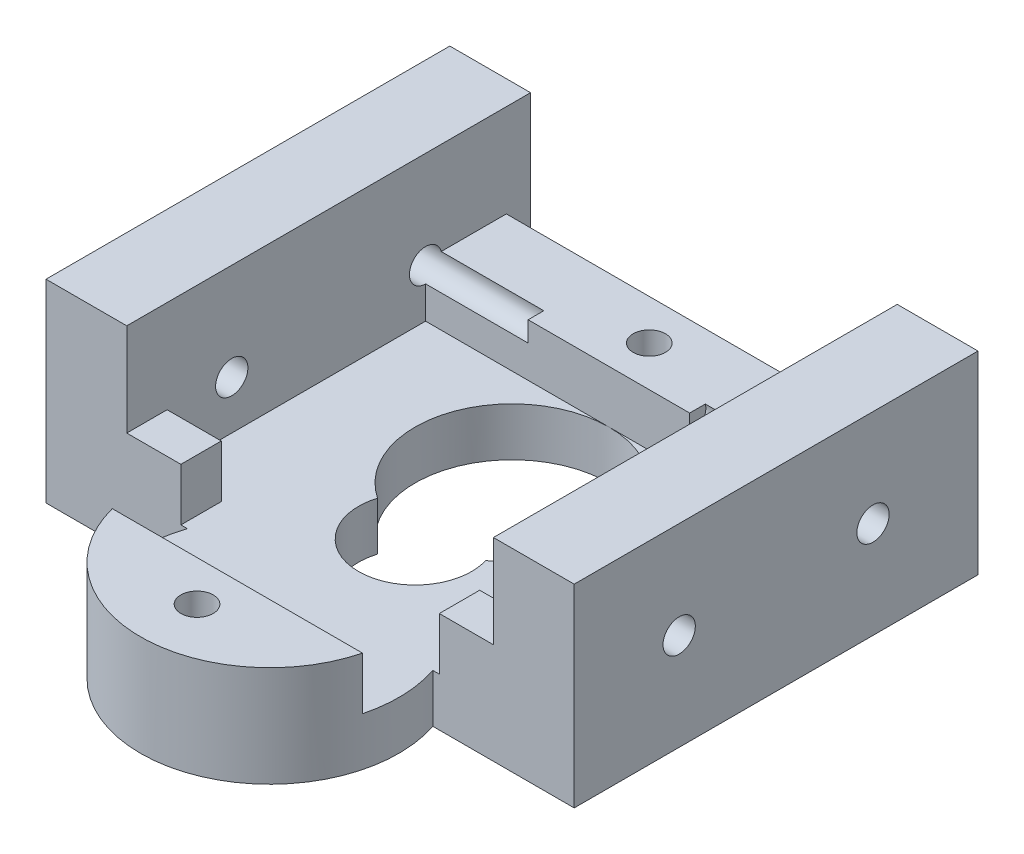
ISO-10303-21;
HEADER;
FILE_DESCRIPTION(('STEP AP214'),'2;1');
FILE_NAME('part.step','',(''),(''),'','','');
FILE_SCHEMA(('AUTOMOTIVE_DESIGN { 1 0 10303 214 1 1 1 1 }'));
ENDSEC;
DATA;
#1=APPLICATION_CONTEXT('core data for automotive mechanical design processes');
#2=APPLICATION_PROTOCOL_DEFINITION('international standard','automotive_design',2000,#1);
#3=PRODUCT_CONTEXT('',#1,'mechanical');
#4=PRODUCT('Part','Part','',(#3));
#5=PRODUCT_RELATED_PRODUCT_CATEGORY('part','',(#4));
#6=PRODUCT_DEFINITION_FORMATION('','',#4);
#7=PRODUCT_DEFINITION_CONTEXT('part definition',#1,'design');
#8=PRODUCT_DEFINITION('design','',#6,#7);
#9=PRODUCT_DEFINITION_SHAPE('','',#8);
#10=(LENGTH_UNIT() NAMED_UNIT(*) SI_UNIT(.MILLI.,.METRE.));
#11=(NAMED_UNIT(*) PLANE_ANGLE_UNIT() SI_UNIT($,.RADIAN.));
#12=(NAMED_UNIT(*) SI_UNIT($,.STERADIAN.) SOLID_ANGLE_UNIT());
#13=UNCERTAINTY_MEASURE_WITH_UNIT(LENGTH_MEASURE(1.E-05),#10,'distance_accuracy_value','');
#14=(GEOMETRIC_REPRESENTATION_CONTEXT(3) GLOBAL_UNCERTAINTY_ASSIGNED_CONTEXT((#13)) GLOBAL_UNIT_ASSIGNED_CONTEXT((#10,
#11,#12)) REPRESENTATION_CONTEXT('',''));
#15=CARTESIAN_POINT('',(0.,0.,0.));
#16=DIRECTION('',(0.,0.,1.));
#17=DIRECTION('',(1.,0.,0.));
#18=AXIS2_PLACEMENT_3D('',#15,#16,#17);
#19=CARTESIAN_POINT('',(0.,6.25,0.));
#20=DIRECTION('',(0.,1.,0.));
#21=DIRECTION('',(0.,0.,1.));
#22=AXIS2_PLACEMENT_3D('',#19,#20,#21);
#23=PLANE('',#22);
#24=DIRECTION('',(1.,0.,0.));
#25=VECTOR('',#24,1.);
#26=CARTESIAN_POINT('',(8.22691143861223,6.25,7.13654379867821));
#27=LINE('',#26,#25);
#28=CARTESIAN_POINT('',(8.22691143861223,6.25,7.13654379867821));
#29=VERTEX_POINT('',#28);
#30=CARTESIAN_POINT('',(11.5769114386122,6.25,7.13654379867821));
#31=VERTEX_POINT('',#30);
#32=EDGE_CURVE('E337',#29,#31,#27,.T.);
#33=ORIENTED_EDGE('',*,*,#32,.T.);
#34=DIRECTION('',(0.,0.,-1.));
#35=VECTOR('',#34,1.);
#36=CARTESIAN_POINT('',(11.5769114386122,6.25,0.));
#37=LINE('',#36,#35);
#38=CARTESIAN_POINT('',(11.5769114386122,6.25,4.63654379867821));
#39=VERTEX_POINT('',#38);
#40=EDGE_CURVE('E539',#31,#39,#37,.T.);
#41=ORIENTED_EDGE('',*,*,#40,.T.);
#42=DIRECTION('',(-1.,0.,0.));
#43=VECTOR('',#42,1.);
#44=CARTESIAN_POINT('',(11.5769114386122,6.25,4.63654379867821));
#45=LINE('',#44,#43);
#46=CARTESIAN_POINT('',(8.22691143861223,6.25,4.63654379867821));
#47=VERTEX_POINT('',#46);
#48=EDGE_CURVE('E331',#39,#47,#45,.T.);
#49=ORIENTED_EDGE('',*,*,#48,.T.);
#50=DIRECTION('',(0.,0.,1.));
#51=VECTOR('',#50,1.);
#52=CARTESIAN_POINT('',(8.22691143861223,6.25,7.13654379867821));
#53=LINE('',#52,#51);
#54=EDGE_CURVE('E334',#47,#29,#53,.T.);
#55=ORIENTED_EDGE('',*,*,#54,.T.);
#56=EDGE_LOOP('',(#33,#41,#49,#55));
#57=FACE_BOUND('',#56,.T.);
#58=ADVANCED_FACE('F39',(#57),#23,.T.);
#59=CARTESIAN_POINT('',(0.226911587156249,6.25,-13.8634563483621));
#60=DIRECTION('',(0.,1.,0.));
#61=DIRECTION('',(0.,0.,1.));
#62=AXIS2_PLACEMENT_3D('',#59,#60,#61);
#63=CIRCLE('',#62,1.00000013768779);
#64=CARTESIAN_POINT('',(0.226911587156249,6.25,-12.8634562106743));
#65=VERTEX_POINT('',#64);
#66=EDGE_CURVE('E642',#65,#65,#63,.T.);
#67=ORIENTED_EDGE('',*,*,#66,.F.);
#68=EDGE_LOOP('',(#67));
#69=FACE_BOUND('',#68,.T.);
#70=DIRECTION('',(1.,0.,0.));
#71=VECTOR('',#70,1.);
#72=CARTESIAN_POINT('',(5.22691182008223,6.25,-12.3317020378736));
#73=LINE('',#72,#71);
#74=CARTESIAN_POINT('',(11.5769114386122,6.25,-12.3317020378736));
#75=VERTEX_POINT('',#74);
#76=CARTESIAN_POINT('',(5.22691182008223,6.25,-12.3317020378736));
#77=VERTEX_POINT('',#76);
#78=EDGE_CURVE('E226',#75,#77,#73,.F.);
#79=ORIENTED_EDGE('',*,*,#78,.F.);
#80=CARTESIAN_POINT('',(11.5769114386122,6.25,-16.3634562013218));
#81=VERTEX_POINT('',#80);
#82=EDGE_CURVE('E536',#75,#81,#37,.T.);
#83=ORIENTED_EDGE('',*,*,#82,.T.);
#84=DIRECTION('',(-1.,0.,0.));
#85=VECTOR('',#84,1.);
#86=CARTESIAN_POINT('',(-11.1230885613878,6.25,-16.3634562013218));
#87=LINE('',#86,#85);
#88=CARTESIAN_POINT('',(-11.1230885613878,6.25,-16.3634562013218));
#89=VERTEX_POINT('',#88);
#90=EDGE_CURVE('E340',#81,#89,#87,.T.);
#91=ORIENTED_EDGE('',*,*,#90,.T.);
#92=DIRECTION('',(0.,0.,-1.));
#93=VECTOR('',#92,1.);
#94=CARTESIAN_POINT('',(-11.1230885613878,6.25,7.13654379867821));
#95=LINE('',#94,#93);
#96=CARTESIAN_POINT('',(-11.1230885613878,6.25,-12.3317020378736));
#97=VERTEX_POINT('',#96);
#98=EDGE_CURVE('E314',#97,#89,#95,.T.);
#99=ORIENTED_EDGE('',*,*,#98,.F.);
#100=DIRECTION('',(-1.,0.,0.));
#101=VECTOR('',#100,1.);
#102=CARTESIAN_POINT('',(-4.77308894285778,6.25,-12.3317020378736));
#103=LINE('',#102,#101);
#104=CARTESIAN_POINT('',(-4.77308894285778,6.25,-12.3317020378736));
#105=VERTEX_POINT('',#104);
#106=EDGE_CURVE('E270',#105,#97,#103,.T.);
#107=ORIENTED_EDGE('',*,*,#106,.F.);
#108=DIRECTION('',(0.,0.,1.));
#109=VECTOR('',#108,1.);
#110=CARTESIAN_POINT('',(-4.77308894285778,6.25,0.));
#111=LINE('',#110,#109);
#112=CARTESIAN_POINT('',(-4.77308894285778,6.25,-11.3627555767347));
#113=VERTEX_POINT('',#112);
#114=EDGE_CURVE('E260',#105,#113,#111,.T.);
#115=ORIENTED_EDGE('',*,*,#114,.T.);
#116=DIRECTION('',(1.,0.,0.));
#117=VECTOR('',#116,1.);
#118=CARTESIAN_POINT('',(-11.1230885613878,6.25,-11.3627555767347));
#119=LINE('',#118,#117);
#120=CARTESIAN_POINT('',(5.22691182008223,6.25,-11.3627555767347));
#121=VERTEX_POINT('',#120);
#122=EDGE_CURVE('E248',#113,#121,#119,.T.);
#123=ORIENTED_EDGE('',*,*,#122,.T.);
#124=DIRECTION('',(0.,0.,-1.));
#125=VECTOR('',#124,1.);
#126=CARTESIAN_POINT('',(5.22691182008223,6.25,0.));
#127=LINE('',#126,#125);
#128=EDGE_CURVE('E235',#121,#77,#127,.T.);
#129=ORIENTED_EDGE('',*,*,#128,.T.);
#130=EDGE_LOOP('',(#79,#83,#91,#99,#107,#115,#123,#129));
#131=FACE_BOUND('',#130,.T.);
#132=ADVANCED_FACE('F245',(#69,#131),#23,.T.);
#133=CARTESIAN_POINT('',(-11.1230885613878,6.25,7.13654379867821));
#134=VERTEX_POINT('',#133);
#135=CARTESIAN_POINT('',(-11.1230885613878,6.25,4.63654379867821));
#136=VERTEX_POINT('',#135);
#137=EDGE_CURVE('E294',#134,#136,#95,.T.);
#138=ORIENTED_EDGE('',*,*,#137,.F.);
#139=DIRECTION('',(1.,0.,0.));
#140=VECTOR('',#139,1.);
#141=CARTESIAN_POINT('',(-16.1230889428578,6.25,7.13654379867821));
#142=LINE('',#141,#140);
#143=CARTESIAN_POINT('',(-7.77308856138777,6.25,7.13654379867821));
#144=VERTEX_POINT('',#143);
#145=EDGE_CURVE('E319',#134,#144,#142,.T.);
#146=ORIENTED_EDGE('',*,*,#145,.T.);
#147=DIRECTION('',(0.,0.,-1.));
#148=VECTOR('',#147,1.);
#149=CARTESIAN_POINT('',(-7.77308856138777,6.25,7.13654379867821));
#150=LINE('',#149,#148);
#151=CARTESIAN_POINT('',(-7.77308856138777,6.25,4.63654379867821));
#152=VERTEX_POINT('',#151);
#153=EDGE_CURVE('E322',#144,#152,#150,.T.);
#154=ORIENTED_EDGE('',*,*,#153,.T.);
#155=DIRECTION('',(-1.,0.,0.));
#156=VECTOR('',#155,1.);
#157=CARTESIAN_POINT('',(-11.1230885613878,6.25,4.63654379867821));
#158=LINE('',#157,#156);
#159=EDGE_CURVE('E326',#152,#136,#158,.T.);
#160=ORIENTED_EDGE('',*,*,#159,.T.);
#161=EDGE_LOOP('',(#138,#146,#154,#160));
#162=FACE_BOUND('',#161,.T.);
#163=ADVANCED_FACE('F679',(#162),#23,.T.);
#164=CARTESIAN_POINT('',(0.226911133434606,3.,9.63654492163518));
#165=DIRECTION('',(0.,1.,0.));
#166=DIRECTION('',(0.,0.,1.));
#167=AXIS2_PLACEMENT_3D('',#164,#165,#166);
#168=PLANE('',#167);
#169=DIRECTION('',(-1.,0.,0.));
#170=VECTOR('',#169,1.);
#171=CARTESIAN_POINT('',(-11.1230885613878,3.,4.63654379867821));
#172=LINE('',#171,#170);
#173=CARTESIAN_POINT('',(-7.77308856138777,3.,4.63654379867821));
#174=VERTEX_POINT('',#173);
#175=CARTESIAN_POINT('',(-11.1230885613878,3.,4.63654379867821));
#176=VERTEX_POINT('',#175);
#177=EDGE_CURVE('E348',#174,#176,#172,.T.);
#178=ORIENTED_EDGE('',*,*,#177,.F.);
#179=DIRECTION('',(0.,0.,-1.));
#180=VECTOR('',#179,1.);
#181=CARTESIAN_POINT('',(-7.77308856138777,3.,7.13654379867821));
#182=LINE('',#181,#180);
#183=CARTESIAN_POINT('',(-7.77308856138777,3.,7.13654379867821));
#184=VERTEX_POINT('',#183);
#185=EDGE_CURVE('E318',#184,#174,#182,.T.);
#186=ORIENTED_EDGE('',*,*,#185,.F.);
#187=DIRECTION('',(1.,0.,0.));
#188=VECTOR('',#187,1.);
#189=CARTESIAN_POINT('',(-16.1230889428578,3.,7.13654379867821));
#190=LINE('',#189,#188);
#191=CARTESIAN_POINT('',(-7.37243040662027,3.,7.13654379867821));
#192=VERTEX_POINT('',#191);
#193=EDGE_CURVE('E481',#184,#192,#190,.T.);
#194=ORIENTED_EDGE('',*,*,#193,.T.);
#195=CARTESIAN_POINT('',(0.226911133434606,3.,9.63654492163518));
#196=DIRECTION('',(0.,1.,0.));
#197=DIRECTION('',(0.,0.,1.));
#198=AXIS2_PLACEMENT_3D('',#195,#196,#197);
#199=CIRCLE('',#198,7.99999984107436);
#200=CARTESIAN_POINT('',(-7.51905539484253,3.,11.6365449216352));
#201=VERTEX_POINT('',#200);
#202=EDGE_CURVE('E486',#192,#201,#199,.T.);
#203=ORIENTED_EDGE('',*,*,#202,.T.);
#204=DIRECTION('',(-1.,0.,0.));
#205=VECTOR('',#204,1.);
#206=CARTESIAN_POINT('',(-7.51905539484253,3.,11.6365449216352));
#207=LINE('',#206,#205);
#208=CARTESIAN_POINT('',(7.97287766171174,3.,11.6365449216352));
#209=VERTEX_POINT('',#208);
#210=EDGE_CURVE('E429',#209,#201,#207,.T.);
#211=ORIENTED_EDGE('',*,*,#210,.F.);
#212=CARTESIAN_POINT('',(7.82625267348948,3.,7.13654379867821));
#213=VERTEX_POINT('',#212);
#214=EDGE_CURVE('E484',#209,#213,#199,.T.);
#215=ORIENTED_EDGE('',*,*,#214,.T.);
#216=DIRECTION('',(1.,0.,0.));
#217=VECTOR('',#216,1.);
#218=CARTESIAN_POINT('',(7.82625267348948,3.,7.13654379867821));
#219=LINE('',#218,#217);
#220=CARTESIAN_POINT('',(8.22691143861223,3.,7.13654379867821));
#221=VERTEX_POINT('',#220);
#222=EDGE_CURVE('E489',#213,#221,#219,.T.);
#223=ORIENTED_EDGE('',*,*,#222,.T.);
#224=DIRECTION('',(0.,0.,1.));
#225=VECTOR('',#224,1.);
#226=CARTESIAN_POINT('',(8.22691143861223,3.,7.13654379867821));
#227=LINE('',#226,#225);
#228=CARTESIAN_POINT('',(8.22691143861223,3.,4.63654379867821));
#229=VERTEX_POINT('',#228);
#230=EDGE_CURVE('E369',#229,#221,#227,.T.);
#231=ORIENTED_EDGE('',*,*,#230,.F.);
#232=DIRECTION('',(-1.,0.,0.));
#233=VECTOR('',#232,1.);
#234=CARTESIAN_POINT('',(11.5769114386122,3.,4.63654379867821));
#235=LINE('',#234,#233);
#236=CARTESIAN_POINT('',(11.5769114386122,3.,4.63654379867821));
#237=VERTEX_POINT('',#236);
#238=EDGE_CURVE('E365',#237,#229,#235,.T.);
#239=ORIENTED_EDGE('',*,*,#238,.F.);
#240=DIRECTION('',(0.,0.,1.));
#241=VECTOR('',#240,1.);
#242=CARTESIAN_POINT('',(11.5769114386122,3.,4.63654379867821));
#243=LINE('',#242,#241);
#244=CARTESIAN_POINT('',(11.5769114386122,3.,-11.3627555767347));
#245=VERTEX_POINT('',#244);
#246=EDGE_CURVE('E361',#245,#237,#243,.T.);
#247=ORIENTED_EDGE('',*,*,#246,.F.);
#248=DIRECTION('',(1.,0.,0.));
#249=VECTOR('',#248,1.);
#250=CARTESIAN_POINT('',(-11.1230885613878,3.,-11.3627555767347));
#251=LINE('',#250,#249);
#252=CARTESIAN_POINT('',(0.225173588169157,3.,-11.3627555767347));
#253=VERTEX_POINT('',#252);
#254=EDGE_CURVE('E356',#253,#245,#251,.T.);
#255=ORIENTED_EDGE('',*,*,#254,.F.);
#256=CARTESIAN_POINT('',(0.225173588169157,3.,-5.36455943319));
#257=DIRECTION('',(0.,1.,0.));
#258=DIRECTION('',(0.,0.,1.));
#259=AXIS2_PLACEMENT_3D('',#256,#257,#258);
#260=CIRCLE('',#259,5.99819614354473);
#261=CARTESIAN_POINT('',(3.57360520697962,3.,-0.387978009101258));
#262=VERTEX_POINT('',#261);
#263=EDGE_CURVE('E457',#262,#253,#260,.T.);
#264=ORIENTED_EDGE('',*,*,#263,.F.);
#265=CARTESIAN_POINT('',(0.226911465942448,3.,0.636543364277263));
#266=DIRECTION('',(0.,1.,0.));
#267=DIRECTION('',(0.,0.,1.));
#268=AXIS2_PLACEMENT_3D('',#265,#266,#267);
#269=CIRCLE('',#268,3.50000043440095);
#270=CARTESIAN_POINT('',(-3.12037510228624,3.,-0.386039478803256));
#271=VERTEX_POINT('',#270);
#272=EDGE_CURVE('E461',#271,#262,#269,.T.);
#273=ORIENTED_EDGE('',*,*,#272,.F.);
#274=EDGE_CURVE('E462',#253,#271,#260,.T.);
#275=ORIENTED_EDGE('',*,*,#274,.F.);
#276=CARTESIAN_POINT('',(-11.1230885613878,3.,-11.3627555767347));
#277=VERTEX_POINT('',#276);
#278=EDGE_CURVE('E357',#277,#253,#251,.T.);
#279=ORIENTED_EDGE('',*,*,#278,.F.);
#280=DIRECTION('',(0.,0.,-1.));
#281=VECTOR('',#280,1.);
#282=CARTESIAN_POINT('',(-11.1230885613878,3.,-11.3627555767347));
#283=LINE('',#282,#281);
#284=EDGE_CURVE('E352',#176,#277,#283,.T.);
#285=ORIENTED_EDGE('',*,*,#284,.F.);
#286=EDGE_LOOP('',(#178,#186,#194,#203,#211,#215,#223,#231,#239,#247,#255,#264,#273,#275,#279,#285));
#287=FACE_BOUND('',#286,.T.);
#288=ADVANCED_FACE('F612',(#287),#168,.T.);
#289=DIRECTION('',(-1.,0.,0.));
#290=VECTOR('',#289,1.);
#291=CARTESIAN_POINT('',(-11.1230885613878,3.,-16.3634562013218));
#292=LINE('',#291,#290);
#293=CARTESIAN_POINT('',(11.5769114386122,3.,-16.3634562013218));
#294=VERTEX_POINT('',#293);
#295=CARTESIAN_POINT('',(-11.1230885613878,3.,-16.3634562013218));
#296=VERTEX_POINT('',#295);
#297=EDGE_CURVE('E377',#294,#296,#292,.T.);
#298=ORIENTED_EDGE('',*,*,#297,.F.);
#299=DIRECTION('',(0.,0.,1.));
#300=VECTOR('',#299,1.);
#301=CARTESIAN_POINT('',(11.5769114386122,3.,-16.3634562013218));
#302=LINE('',#301,#300);
#303=CARTESIAN_POINT('',(11.5769114386122,3.,-17.8634562013218));
#304=VERTEX_POINT('',#303);
#305=EDGE_CURVE('E373',#304,#294,#302,.T.);
#306=ORIENTED_EDGE('',*,*,#305,.F.);
#307=DIRECTION('',(-1.,0.,0.));
#308=VECTOR('',#307,1.);
#309=CARTESIAN_POINT('',(-16.1230889428578,3.,-17.8634562013218));
#310=LINE('',#309,#308);
#311=CARTESIAN_POINT('',(-11.1230885613878,3.,-17.8634562013218));
#312=VERTEX_POINT('',#311);
#313=EDGE_CURVE('E492',#304,#312,#310,.T.);
#314=ORIENTED_EDGE('',*,*,#313,.T.);
#315=DIRECTION('',(0.,0.,-1.));
#316=VECTOR('',#315,1.);
#317=CARTESIAN_POINT('',(-11.1230885613878,3.,-17.8634562013218));
#318=LINE('',#317,#316);
#319=EDGE_CURVE('E323',#296,#312,#318,.T.);
#320=ORIENTED_EDGE('',*,*,#319,.F.);
#321=EDGE_LOOP('',(#298,#306,#314,#320));
#322=FACE_BOUND('',#321,.T.);
#323=ADVANCED_FACE('F597',(#322),#168,.T.);
#324=CARTESIAN_POINT('',(0.226911133434606,0.,9.63654492163518));
#325=DIRECTION('',(0.,1.,0.));
#326=DIRECTION('',(0.,0.,1.));
#327=AXIS2_PLACEMENT_3D('',#324,#325,#326);
#328=PLANE('',#327);
#329=DIRECTION('',(0.,0.,1.));
#330=VECTOR('',#329,1.);
#331=CARTESIAN_POINT('',(-16.1230889428578,0.,-17.8634562013218));
#332=LINE('',#331,#330);
#333=CARTESIAN_POINT('',(-16.1230889428578,0.,-17.8634562013218));
#334=VERTEX_POINT('',#333);
#335=CARTESIAN_POINT('',(-16.1230889428578,0.,7.13654379867821));
#336=VERTEX_POINT('',#335);
#337=EDGE_CURVE('E480',#334,#336,#332,.T.);
#338=ORIENTED_EDGE('',*,*,#337,.F.);
#339=DIRECTION('',(-1.,0.,0.));
#340=VECTOR('',#339,1.);
#341=CARTESIAN_POINT('',(-16.1230889428578,0.,-17.8634562013218));
#342=LINE('',#341,#340);
#343=CARTESIAN_POINT('',(16.5769118200822,0.,-17.8634562013218));
#344=VERTEX_POINT('',#343);
#345=EDGE_CURVE('E485',#344,#334,#342,.T.);
#346=ORIENTED_EDGE('',*,*,#345,.F.);
#347=DIRECTION('',(0.,0.,-1.));
#348=VECTOR('',#347,1.);
#349=CARTESIAN_POINT('',(16.5769118200822,0.,-17.8634562013218));
#350=LINE('',#349,#348);
#351=CARTESIAN_POINT('',(16.5769118200822,0.,7.13654379867821));
#352=VERTEX_POINT('',#351);
#353=EDGE_CURVE('E508',#352,#344,#350,.T.);
#354=ORIENTED_EDGE('',*,*,#353,.F.);
#355=DIRECTION('',(1.,0.,0.));
#356=VECTOR('',#355,1.);
#357=CARTESIAN_POINT('',(7.82625267348948,0.,7.13654379867821));
#358=LINE('',#357,#356);
#359=CARTESIAN_POINT('',(7.82625267348948,0.,7.13654379867821));
#360=VERTEX_POINT('',#359);
#361=EDGE_CURVE('E505',#360,#352,#358,.T.);
#362=ORIENTED_EDGE('',*,*,#361,.F.);
#363=CARTESIAN_POINT('',(0.226911133434606,0.,9.63654492163518));
#364=DIRECTION('',(0.,1.,0.));
#365=DIRECTION('',(0.,0.,1.));
#366=AXIS2_PLACEMENT_3D('',#363,#364,#365);
#367=CIRCLE('',#366,7.99999984107436);
#368=CARTESIAN_POINT('',(-7.37243040662027,0.,7.13654379867821));
#369=VERTEX_POINT('',#368);
#370=EDGE_CURVE('E502',#369,#360,#367,.T.);
#371=ORIENTED_EDGE('',*,*,#370,.F.);
#372=DIRECTION('',(1.,0.,0.));
#373=VECTOR('',#372,1.);
#374=CARTESIAN_POINT('',(-16.1230889428578,0.,7.13654379867821));
#375=LINE('',#374,#373);
#376=EDGE_CURVE('E499',#336,#369,#375,.T.);
#377=ORIENTED_EDGE('',*,*,#376,.F.);
#378=EDGE_LOOP('',(#338,#346,#354,#362,#371,#377));
#379=FACE_BOUND('',#378,.T.);
#380=CARTESIAN_POINT('',(0.225173588169157,0.,-5.36455943319));
#381=DIRECTION('',(0.,1.,0.));
#382=DIRECTION('',(0.,0.,1.));
#383=AXIS2_PLACEMENT_3D('',#380,#381,#382);
#384=CIRCLE('',#383,5.99819614354473);
#385=CARTESIAN_POINT('',(3.57360520697962,0.,-0.387978009101258));
#386=VERTEX_POINT('',#385);
#387=CARTESIAN_POINT('',(-3.12037510228624,0.,-0.386039478803256));
#388=VERTEX_POINT('',#387);
#389=EDGE_CURVE('E456',#386,#388,#384,.T.);
#390=ORIENTED_EDGE('',*,*,#389,.T.);
#391=CARTESIAN_POINT('',(0.226911465942448,0.,0.636543364277263));
#392=DIRECTION('',(0.,1.,0.));
#393=DIRECTION('',(0.,0.,1.));
#394=AXIS2_PLACEMENT_3D('',#391,#392,#393);
#395=CIRCLE('',#394,3.50000043440095);
#396=EDGE_CURVE('E469',#388,#386,#395,.T.);
#397=ORIENTED_EDGE('',*,*,#396,.T.);
#398=EDGE_LOOP('',(#390,#397));
#399=FACE_BOUND('',#398,.T.);
#400=CARTESIAN_POINT('',(0.226911587156249,0.,-13.8634563483621));
#401=DIRECTION('',(0.,1.,0.));
#402=DIRECTION('',(0.,0.,1.));
#403=AXIS2_PLACEMENT_3D('',#400,#401,#402);
#404=CIRCLE('',#403,1.00000013768779);
#405=CARTESIAN_POINT('',(0.226911587156249,0.,-12.8634562106743));
#406=VERTEX_POINT('',#405);
#407=EDGE_CURVE('E452',#406,#406,#404,.T.);
#408=ORIENTED_EDGE('',*,*,#407,.T.);
#409=EDGE_LOOP('',(#408));
#410=FACE_BOUND('',#409,.T.);
#411=CARTESIAN_POINT('',(0.226910898310446,0.,14.1365449063109));
#412=DIRECTION('',(0.,1.,0.));
#413=DIRECTION('',(0.,0.,1.));
#414=AXIS2_PLACEMENT_3D('',#411,#412,#413);
#415=CIRCLE('',#414,0.999999988942974);
#416=CARTESIAN_POINT('',(0.226910898310446,0.,15.1365448952539));
#417=VERTEX_POINT('',#416);
#418=EDGE_CURVE('E448',#417,#417,#415,.T.);
#419=ORIENTED_EDGE('',*,*,#418,.T.);
#420=EDGE_LOOP('',(#419));
#421=FACE_BOUND('',#420,.T.);
#422=ADVANCED_FACE('F621',(#379,#399,#410,#421),#328,.F.);
#423=CARTESIAN_POINT('',(-16.1230889428578,3.,-17.8634562013218));
#424=DIRECTION('',(1.,0.,0.));
#425=DIRECTION('',(0.,0.,-1.));
#426=AXIS2_PLACEMENT_3D('',#423,#424,#425);
#427=PLANE('',#426);
#428=CARTESIAN_POINT('',(-16.1230889428578,6.,-11.3634562013218));
#429=DIRECTION('',(-1.,0.,0.));
#430=DIRECTION('',(0.,0.,1.));
#431=AXIS2_PLACEMENT_3D('',#428,#429,#430);
#432=CIRCLE('',#431,1.);
#433=CARTESIAN_POINT('',(-16.1230889428578,6.,-10.3634562013218));
#434=VERTEX_POINT('',#433);
#435=EDGE_CURVE('E254',#434,#434,#432,.T.);
#436=ORIENTED_EDGE('',*,*,#435,.F.);
#437=EDGE_LOOP('',(#436));
#438=FACE_BOUND('',#437,.T.);
#439=CARTESIAN_POINT('',(-16.1230889428578,6.,0.636543798678207));
#440=DIRECTION('',(-1.,0.,0.));
#441=DIRECTION('',(0.,0.,1.));
#442=AXIS2_PLACEMENT_3D('',#439,#440,#441);
#443=CIRCLE('',#442,1.);
#444=CARTESIAN_POINT('',(-16.1230889428578,6.,1.63654379867821));
#445=VERTEX_POINT('',#444);
#446=EDGE_CURVE('E250',#445,#445,#443,.T.);
#447=ORIENTED_EDGE('',*,*,#446,.F.);
#448=EDGE_LOOP('',(#447));
#449=FACE_BOUND('',#448,.T.);
#450=ORIENTED_EDGE('',*,*,#337,.T.);
#451=DIRECTION('',(0.,-1.,0.));
#452=VECTOR('',#451,1.);
#453=CARTESIAN_POINT('',(-16.1230889428578,3.,7.13654379867821));
#454=LINE('',#453,#452);
#455=CARTESIAN_POINT('',(-16.1230889428578,12.,7.13654379867821));
#456=VERTEX_POINT('',#455);
#457=EDGE_CURVE('E532',#456,#336,#454,.T.);
#458=ORIENTED_EDGE('',*,*,#457,.F.);
#459=DIRECTION('',(0.,0.,1.));
#460=VECTOR('',#459,1.);
#461=CARTESIAN_POINT('',(-16.1230889428578,12.,7.13654379867821));
#462=LINE('',#461,#460);
#463=CARTESIAN_POINT('',(-16.1230889428578,12.,-17.8634562013218));
#464=VERTEX_POINT('',#463);
#465=EDGE_CURVE('E295',#464,#456,#462,.T.);
#466=ORIENTED_EDGE('',*,*,#465,.F.);
#467=DIRECTION('',(0.,-1.,0.));
#468=VECTOR('',#467,1.);
#469=CARTESIAN_POINT('',(-16.1230889428578,3.,-17.8634562013218));
#470=LINE('',#469,#468);
#471=EDGE_CURVE('E495',#464,#334,#470,.T.);
#472=ORIENTED_EDGE('',*,*,#471,.T.);
#473=EDGE_LOOP('',(#450,#458,#466,#472));
#474=FACE_BOUND('',#473,.T.);
#475=ADVANCED_FACE('F41',(#438,#449,#474),#427,.F.);
#476=CARTESIAN_POINT('',(-16.1230889428578,3.,7.13654379867821));
#477=DIRECTION('',(0.,0.,-1.));
#478=DIRECTION('',(-1.,0.,0.));
#479=AXIS2_PLACEMENT_3D('',#476,#477,#478);
#480=PLANE('',#479);
#481=ORIENTED_EDGE('',*,*,#376,.T.);
#482=DIRECTION('',(0.,-1.,0.));
#483=VECTOR('',#482,1.);
#484=CARTESIAN_POINT('',(-7.37243040662027,3.,7.13654379867821));
#485=LINE('',#484,#483);
#486=EDGE_CURVE('E528',#192,#369,#485,.T.);
#487=ORIENTED_EDGE('',*,*,#486,.F.);
#488=ORIENTED_EDGE('',*,*,#193,.F.);
#489=DIRECTION('',(0.,-1.,0.));
#490=VECTOR('',#489,1.);
#491=CARTESIAN_POINT('',(-7.77308856138777,6.25,7.13654379867821));
#492=LINE('',#491,#490);
#493=EDGE_CURVE('E425',#144,#184,#492,.T.);
#494=ORIENTED_EDGE('',*,*,#493,.F.);
#495=ORIENTED_EDGE('',*,*,#145,.F.);
#496=DIRECTION('',(0.,-1.,0.));
#497=VECTOR('',#496,1.);
#498=CARTESIAN_POINT('',(-11.1230885613878,12.,7.13654379867821));
#499=LINE('',#498,#497);
#500=CARTESIAN_POINT('',(-11.1230885613878,12.,7.13654379867821));
#501=VERTEX_POINT('',#500);
#502=EDGE_CURVE('E310',#501,#134,#499,.T.);
#503=ORIENTED_EDGE('',*,*,#502,.F.);
#504=DIRECTION('',(1.,0.,0.));
#505=VECTOR('',#504,1.);
#506=CARTESIAN_POINT('',(-16.1230889428578,12.,7.13654379867821));
#507=LINE('',#506,#505);
#508=EDGE_CURVE('E299',#456,#501,#507,.T.);
#509=ORIENTED_EDGE('',*,*,#508,.F.);
#510=ORIENTED_EDGE('',*,*,#457,.T.);
#511=EDGE_LOOP('',(#481,#487,#488,#494,#495,#503,#509,#510));
#512=FACE_BOUND('',#511,.T.);
#513=ADVANCED_FACE('F674',(#512),#480,.F.);
#514=CARTESIAN_POINT('',(0.226911133434606,3.,9.63654492163518));
#515=DIRECTION('',(0.,-1.,0.));
#516=DIRECTION('',(0.,0.,-1.));
#517=AXIS2_PLACEMENT_3D('',#514,#515,#516);
#518=CYLINDRICAL_SURFACE('',#517,7.99999984107436);
#519=ORIENTED_EDGE('',*,*,#370,.T.);
#520=DIRECTION('',(0.,-1.,0.));
#521=VECTOR('',#520,1.);
#522=CARTESIAN_POINT('',(7.82625267348948,3.,7.13654379867821));
#523=LINE('',#522,#521);
#524=EDGE_CURVE('E524',#213,#360,#523,.T.);
#525=ORIENTED_EDGE('',*,*,#524,.F.);
#526=ORIENTED_EDGE('',*,*,#214,.F.);
#527=DIRECTION('',(0.,-1.,0.));
#528=VECTOR('',#527,1.);
#529=CARTESIAN_POINT('',(7.97287766171174,6.25,11.6365449216352));
#530=LINE('',#529,#528);
#531=CARTESIAN_POINT('',(7.97287766171174,6.25,11.6365449216352));
#532=VERTEX_POINT('',#531);
#533=EDGE_CURVE('E444',#532,#209,#530,.T.);
#534=ORIENTED_EDGE('',*,*,#533,.F.);
#535=CARTESIAN_POINT('',(0.226911133434606,6.25,9.63654492163518));
#536=DIRECTION('',(0.,1.,0.));
#537=DIRECTION('',(0.,0.,1.));
#538=AXIS2_PLACEMENT_3D('',#535,#536,#537);
#539=CIRCLE('',#538,7.99999984107436);
#540=CARTESIAN_POINT('',(-7.51905539484253,6.25,11.6365449216352));
#541=VERTEX_POINT('',#540);
#542=EDGE_CURVE('E430',#541,#532,#539,.T.);
#543=ORIENTED_EDGE('',*,*,#542,.F.);
#544=DIRECTION('',(0.,-1.,0.));
#545=VECTOR('',#544,1.);
#546=CARTESIAN_POINT('',(-7.51905539484253,6.25,11.6365449216352));
#547=LINE('',#546,#545);
#548=EDGE_CURVE('E437',#541,#201,#547,.T.);
#549=ORIENTED_EDGE('',*,*,#548,.T.);
#550=ORIENTED_EDGE('',*,*,#202,.F.);
#551=ORIENTED_EDGE('',*,*,#486,.T.);
#552=EDGE_LOOP('',(#519,#525,#526,#534,#543,#549,#550,#551));
#553=FACE_BOUND('',#552,.T.);
#554=ADVANCED_FACE('F721',(#553),#518,.T.);
#555=CARTESIAN_POINT('',(7.82625267348948,3.,7.13654379867821));
#556=DIRECTION('',(0.,0.,-1.));
#557=DIRECTION('',(-1.,0.,0.));
#558=AXIS2_PLACEMENT_3D('',#555,#556,#557);
#559=PLANE('',#558);
#560=ORIENTED_EDGE('',*,*,#361,.T.);
#561=DIRECTION('',(0.,-1.,0.));
#562=VECTOR('',#561,1.);
#563=CARTESIAN_POINT('',(16.5769118200822,3.,7.13654379867821));
#564=LINE('',#563,#562);
#565=CARTESIAN_POINT('',(16.5769118200822,12.,7.13654379867821));
#566=VERTEX_POINT('',#565);
#567=EDGE_CURVE('E520',#566,#352,#564,.T.);
#568=ORIENTED_EDGE('',*,*,#567,.F.);
#569=DIRECTION('',(1.,0.,0.));
#570=VECTOR('',#569,1.);
#571=CARTESIAN_POINT('',(11.5769114386122,12.,7.13654379867821));
#572=LINE('',#571,#570);
#573=CARTESIAN_POINT('',(11.5769114386122,12.,7.13654379867821));
#574=VERTEX_POINT('',#573);
#575=EDGE_CURVE('E278',#574,#566,#572,.T.);
#576=ORIENTED_EDGE('',*,*,#575,.F.);
#577=DIRECTION('',(0.,-1.,0.));
#578=VECTOR('',#577,1.);
#579=CARTESIAN_POINT('',(11.5769114386122,12.,7.13654379867821));
#580=LINE('',#579,#578);
#581=EDGE_CURVE('E290',#574,#31,#580,.T.);
#582=ORIENTED_EDGE('',*,*,#581,.T.);
#583=ORIENTED_EDGE('',*,*,#32,.F.);
#584=DIRECTION('',(0.,-1.,0.));
#585=VECTOR('',#584,1.);
#586=CARTESIAN_POINT('',(8.22691143861223,6.25,7.13654379867821));
#587=LINE('',#586,#585);
#588=EDGE_CURVE('E399',#29,#221,#587,.T.);
#589=ORIENTED_EDGE('',*,*,#588,.T.);
#590=ORIENTED_EDGE('',*,*,#222,.F.);
#591=ORIENTED_EDGE('',*,*,#524,.T.);
#592=EDGE_LOOP('',(#560,#568,#576,#582,#583,#589,#590,#591));
#593=FACE_BOUND('',#592,.T.);
#594=ADVANCED_FACE('F585',(#593),#559,.F.);
#595=CARTESIAN_POINT('',(16.5769118200822,3.,-17.8634562013218));
#596=DIRECTION('',(-1.,0.,0.));
#597=DIRECTION('',(0.,0.,1.));
#598=AXIS2_PLACEMENT_3D('',#595,#596,#597);
#599=PLANE('',#598);
#600=CARTESIAN_POINT('',(16.5769118200822,6.,-11.3634562013218));
#601=DIRECTION('',(1.,0.,0.));
#602=DIRECTION('',(0.,0.,-1.));
#603=AXIS2_PLACEMENT_3D('',#600,#601,#602);
#604=CIRCLE('',#603,1.);
#605=CARTESIAN_POINT('',(16.5769118200822,6.,-12.3634562013218));
#606=VERTEX_POINT('',#605);
#607=EDGE_CURVE('E242',#606,#606,#604,.T.);
#608=ORIENTED_EDGE('',*,*,#607,.F.);
#609=EDGE_LOOP('',(#608));
#610=FACE_BOUND('',#609,.T.);
#611=CARTESIAN_POINT('',(16.5769118200822,6.,0.636543798678208));
#612=DIRECTION('',(1.,0.,0.));
#613=DIRECTION('',(0.,0.,-1.));
#614=AXIS2_PLACEMENT_3D('',#611,#612,#613);
#615=CIRCLE('',#614,1.);
#616=CARTESIAN_POINT('',(16.5769118200822,6.,-0.363456201321792));
#617=VERTEX_POINT('',#616);
#618=EDGE_CURVE('E641',#617,#617,#615,.T.);
#619=ORIENTED_EDGE('',*,*,#618,.F.);
#620=EDGE_LOOP('',(#619));
#621=FACE_BOUND('',#620,.T.);
#622=ORIENTED_EDGE('',*,*,#353,.T.);
#623=DIRECTION('',(0.,-1.,0.));
#624=VECTOR('',#623,1.);
#625=CARTESIAN_POINT('',(16.5769118200822,3.,-17.8634562013218));
#626=LINE('',#625,#624);
#627=CARTESIAN_POINT('',(16.5769118200822,12.,-17.8634562013218));
#628=VERTEX_POINT('',#627);
#629=EDGE_CURVE('E516',#628,#344,#626,.T.);
#630=ORIENTED_EDGE('',*,*,#629,.F.);
#631=DIRECTION('',(0.,0.,-1.));
#632=VECTOR('',#631,1.);
#633=CARTESIAN_POINT('',(16.5769118200822,12.,-17.8634562013218));
#634=LINE('',#633,#632);
#635=EDGE_CURVE('E282',#566,#628,#634,.T.);
#636=ORIENTED_EDGE('',*,*,#635,.F.);
#637=ORIENTED_EDGE('',*,*,#567,.T.);
#638=EDGE_LOOP('',(#622,#630,#636,#637));
#639=FACE_BOUND('',#638,.T.);
#640=ADVANCED_FACE('F656',(#610,#621,#639),#599,.F.);
#641=CARTESIAN_POINT('',(-16.1230889428578,3.,-17.8634562013218));
#642=DIRECTION('',(0.,0.,1.));
#643=DIRECTION('',(1.,0.,0.));
#644=AXIS2_PLACEMENT_3D('',#641,#642,#643);
#645=PLANE('',#644);
#646=ORIENTED_EDGE('',*,*,#345,.T.);
#647=ORIENTED_EDGE('',*,*,#471,.F.);
#648=DIRECTION('',(-1.,0.,0.));
#649=VECTOR('',#648,1.);
#650=CARTESIAN_POINT('',(-16.1230889428578,12.,-17.8634562013218));
#651=LINE('',#650,#649);
#652=CARTESIAN_POINT('',(-11.1230885613878,12.,-17.8634562013218));
#653=VERTEX_POINT('',#652);
#654=EDGE_CURVE('E306',#653,#464,#651,.T.);
#655=ORIENTED_EDGE('',*,*,#654,.F.);
#656=DIRECTION('',(0.,-1.,0.));
#657=VECTOR('',#656,1.);
#658=CARTESIAN_POINT('',(-11.1230885613878,6.25,-17.8634562013218));
#659=LINE('',#658,#657);
#660=EDGE_CURVE('E344',#653,#312,#659,.T.);
#661=ORIENTED_EDGE('',*,*,#660,.T.);
#662=ORIENTED_EDGE('',*,*,#313,.F.);
#663=DIRECTION('',(0.,-1.,0.));
#664=VECTOR('',#663,1.);
#665=CARTESIAN_POINT('',(11.5769114386122,6.25,-17.8634562013218));
#666=LINE('',#665,#664);
#667=CARTESIAN_POINT('',(11.5769114386122,12.,-17.8634562013218));
#668=VERTEX_POINT('',#667);
#669=EDGE_CURVE('E395',#668,#304,#666,.T.);
#670=ORIENTED_EDGE('',*,*,#669,.F.);
#671=DIRECTION('',(-1.,0.,0.));
#672=VECTOR('',#671,1.);
#673=CARTESIAN_POINT('',(11.5769114386122,12.,-17.8634562013218));
#674=LINE('',#673,#672);
#675=EDGE_CURVE('E286',#628,#668,#674,.T.);
#676=ORIENTED_EDGE('',*,*,#675,.F.);
#677=ORIENTED_EDGE('',*,*,#629,.T.);
#678=EDGE_LOOP('',(#646,#647,#655,#661,#662,#670,#676,#677));
#679=FACE_BOUND('',#678,.T.);
#680=ADVANCED_FACE('F592',(#679),#645,.F.);
#681=CARTESIAN_POINT('',(0.225173588169157,3.,-5.36455943319));
#682=DIRECTION('',(0.,-1.,0.));
#683=DIRECTION('',(0.,0.,-1.));
#684=AXIS2_PLACEMENT_3D('',#681,#682,#683);
#685=CYLINDRICAL_SURFACE('',#684,5.99819614354473);
#686=ORIENTED_EDGE('',*,*,#389,.F.);
#687=DIRECTION('',(0.,-1.,0.));
#688=VECTOR('',#687,1.);
#689=CARTESIAN_POINT('',(3.57360520697962,3.,-0.387978009101258));
#690=LINE('',#689,#688);
#691=EDGE_CURVE('E465',#262,#386,#690,.T.);
#692=ORIENTED_EDGE('',*,*,#691,.F.);
#693=ORIENTED_EDGE('',*,*,#263,.T.);
#694=ORIENTED_EDGE('',*,*,#274,.T.);
#695=DIRECTION('',(0.,-1.,0.));
#696=VECTOR('',#695,1.);
#697=CARTESIAN_POINT('',(-3.12037510228624,3.,-0.386039478803256));
#698=LINE('',#697,#696);
#699=EDGE_CURVE('E476',#271,#388,#698,.T.);
#700=ORIENTED_EDGE('',*,*,#699,.T.);
#701=EDGE_LOOP('',(#686,#692,#693,#694,#700));
#702=FACE_BOUND('',#701,.T.);
#703=ADVANCED_FACE('F617',(#702),#685,.F.);
#704=CARTESIAN_POINT('',(0.226911465942448,3.,0.636543364277263));
#705=DIRECTION('',(0.,-1.,0.));
#706=DIRECTION('',(0.,0.,-1.));
#707=AXIS2_PLACEMENT_3D('',#704,#705,#706);
#708=CYLINDRICAL_SURFACE('',#707,3.50000043440095);
#709=ORIENTED_EDGE('',*,*,#396,.F.);
#710=ORIENTED_EDGE('',*,*,#699,.F.);
#711=ORIENTED_EDGE('',*,*,#272,.T.);
#712=ORIENTED_EDGE('',*,*,#691,.T.);
#713=EDGE_LOOP('',(#709,#710,#711,#712));
#714=FACE_BOUND('',#713,.T.);
#715=ADVANCED_FACE('F619',(#714),#708,.F.);
#716=CARTESIAN_POINT('',(0.226911587156249,3.,-13.8634563483621));
#717=DIRECTION('',(0.,-1.,0.));
#718=DIRECTION('',(0.,0.,-1.));
#719=AXIS2_PLACEMENT_3D('',#716,#717,#718);
#720=CYLINDRICAL_SURFACE('',#719,1.00000013768779);
#721=ORIENTED_EDGE('',*,*,#407,.F.);
#722=EDGE_LOOP('',(#721));
#723=FACE_BOUND('',#722,.T.);
#724=ORIENTED_EDGE('',*,*,#66,.T.);
#725=EDGE_LOOP('',(#724));
#726=FACE_BOUND('',#725,.T.);
#727=ADVANCED_FACE('F634',(#723,#726),#720,.F.);
#728=CARTESIAN_POINT('',(0.226910898310446,3.,14.1365449063109));
#729=DIRECTION('',(0.,-1.,0.));
#730=DIRECTION('',(0.,0.,-1.));
#731=AXIS2_PLACEMENT_3D('',#728,#729,#730);
#732=CYLINDRICAL_SURFACE('',#731,0.999999988942974);
#733=ORIENTED_EDGE('',*,*,#418,.F.);
#734=EDGE_LOOP('',(#733));
#735=FACE_BOUND('',#734,.T.);
#736=CARTESIAN_POINT('',(0.226910898310446,6.25,14.1365449063109));
#737=DIRECTION('',(0.,1.,0.));
#738=DIRECTION('',(0.,0.,1.));
#739=AXIS2_PLACEMENT_3D('',#736,#737,#738);
#740=CIRCLE('',#739,0.999999988942974);
#741=CARTESIAN_POINT('',(0.226910898310446,6.25,15.1365448952539));
#742=VERTEX_POINT('',#741);
#743=EDGE_CURVE('E638',#742,#742,#740,.T.);
#744=ORIENTED_EDGE('',*,*,#743,.T.);
#745=EDGE_LOOP('',(#744));
#746=FACE_BOUND('',#745,.T.);
#747=ADVANCED_FACE('F630',(#735,#746),#732,.F.);
#748=CARTESIAN_POINT('',(0.226911133434606,6.25,9.63654492163518));
#749=DIRECTION('',(0.,1.,0.));
#750=DIRECTION('',(0.,0.,1.));
#751=AXIS2_PLACEMENT_3D('',#748,#749,#750);
#752=PLANE('',#751);
#753=ORIENTED_EDGE('',*,*,#743,.F.);
#754=EDGE_LOOP('',(#753));
#755=FACE_BOUND('',#754,.T.);
#756=ORIENTED_EDGE('',*,*,#542,.T.);
#757=DIRECTION('',(-1.,0.,0.));
#758=VECTOR('',#757,1.);
#759=CARTESIAN_POINT('',(-7.51905539484253,6.25,11.6365449216352));
#760=LINE('',#759,#758);
#761=EDGE_CURVE('E434',#532,#541,#760,.T.);
#762=ORIENTED_EDGE('',*,*,#761,.T.);
#763=EDGE_LOOP('',(#756,#762));
#764=FACE_BOUND('',#763,.T.);
#765=ADVANCED_FACE('F633',(#755,#764),#752,.T.);
#766=CARTESIAN_POINT('',(-7.51905539484253,6.25,11.6365449216352));
#767=DIRECTION('',(0.,0.,1.));
#768=DIRECTION('',(1.,0.,0.));
#769=AXIS2_PLACEMENT_3D('',#766,#767,#768);
#770=PLANE('',#769);
#771=ORIENTED_EDGE('',*,*,#210,.T.);
#772=ORIENTED_EDGE('',*,*,#548,.F.);
#773=ORIENTED_EDGE('',*,*,#761,.F.);
#774=ORIENTED_EDGE('',*,*,#533,.T.);
#775=EDGE_LOOP('',(#771,#772,#773,#774));
#776=FACE_BOUND('',#775,.T.);
#777=ADVANCED_FACE('F688',(#776),#770,.F.);
#778=CARTESIAN_POINT('',(-7.77308856138777,6.25,7.13654379867821));
#779=DIRECTION('',(-1.,0.,0.));
#780=DIRECTION('',(0.,0.,1.));
#781=AXIS2_PLACEMENT_3D('',#778,#779,#780);
#782=PLANE('',#781);
#783=ORIENTED_EDGE('',*,*,#185,.T.);
#784=DIRECTION('',(0.,-1.,0.));
#785=VECTOR('',#784,1.);
#786=CARTESIAN_POINT('',(-7.77308856138777,6.25,4.63654379867821));
#787=LINE('',#786,#785);
#788=EDGE_CURVE('E421',#152,#174,#787,.T.);
#789=ORIENTED_EDGE('',*,*,#788,.F.);
#790=ORIENTED_EDGE('',*,*,#153,.F.);
#791=ORIENTED_EDGE('',*,*,#493,.T.);
#792=EDGE_LOOP('',(#783,#789,#790,#791));
#793=FACE_BOUND('',#792,.T.);
#794=ADVANCED_FACE('F686',(#793),#782,.F.);
#795=CARTESIAN_POINT('',(-11.1230885613878,6.25,4.63654379867821));
#796=DIRECTION('',(0.,0.,1.));
#797=DIRECTION('',(1.,0.,0.));
#798=AXIS2_PLACEMENT_3D('',#795,#796,#797);
#799=PLANE('',#798);
#800=ORIENTED_EDGE('',*,*,#177,.T.);
#801=DIRECTION('',(0.,-1.,0.));
#802=VECTOR('',#801,1.);
#803=CARTESIAN_POINT('',(-11.1230885613878,6.25,4.63654379867821));
#804=LINE('',#803,#802);
#805=EDGE_CURVE('E417',#136,#176,#804,.T.);
#806=ORIENTED_EDGE('',*,*,#805,.F.);
#807=ORIENTED_EDGE('',*,*,#159,.F.);
#808=ORIENTED_EDGE('',*,*,#788,.T.);
#809=EDGE_LOOP('',(#800,#806,#807,#808));
#810=FACE_BOUND('',#809,.T.);
#811=ADVANCED_FACE('F684',(#810),#799,.F.);
#812=CARTESIAN_POINT('',(-11.1230885613878,6.25,-11.3627555767347));
#813=DIRECTION('',(-1.,0.,0.));
#814=DIRECTION('',(0.,0.,1.));
#815=AXIS2_PLACEMENT_3D('',#812,#813,#814);
#816=PLANE('',#815);
#817=CARTESIAN_POINT('',(-11.1230885613878,6.,0.636543798678207));
#818=DIRECTION('',(-1.,0.,0.));
#819=DIRECTION('',(0.,0.,1.));
#820=AXIS2_PLACEMENT_3D('',#817,#818,#819);
#821=CIRCLE('',#820,1.);
#822=CARTESIAN_POINT('',(-11.1230885613878,6.,1.63654379867821));
#823=VERTEX_POINT('',#822);
#824=EDGE_CURVE('E273',#823,#823,#821,.T.);
#825=ORIENTED_EDGE('',*,*,#824,.T.);
#826=EDGE_LOOP('',(#825));
#827=FACE_BOUND('',#826,.T.);
#828=DIRECTION('',(0.,-1.,0.));
#829=VECTOR('',#828,1.);
#830=CARTESIAN_POINT('',(-11.1230885613878,6.25,-11.3627555767347));
#831=LINE('',#830,#829);
#832=CARTESIAN_POINT('',(-11.1230885613878,5.00000024543743,-11.3627555767347));
#833=VERTEX_POINT('',#832);
#834=EDGE_CURVE('E414',#833,#277,#831,.T.);
#835=ORIENTED_EDGE('',*,*,#834,.F.);
#836=CARTESIAN_POINT('',(-11.1230885613878,6.,-11.3634562013218));
#837=DIRECTION('',(-1.,0.,0.));
#838=DIRECTION('',(0.,0.,1.));
#839=AXIS2_PLACEMENT_3D('',#836,#837,#838);
#840=CIRCLE('',#839,1.);
#841=EDGE_CURVE('E266',#833,#97,#840,.T.);
#842=ORIENTED_EDGE('',*,*,#841,.T.);
#843=ORIENTED_EDGE('',*,*,#98,.T.);
#844=DIRECTION('',(0.,-1.,0.));
#845=VECTOR('',#844,1.);
#846=CARTESIAN_POINT('',(-11.1230885613878,6.25,-16.3634562013218));
#847=LINE('',#846,#845);
#848=EDGE_CURVE('E387',#89,#296,#847,.T.);
#849=ORIENTED_EDGE('',*,*,#848,.T.);
#850=ORIENTED_EDGE('',*,*,#319,.T.);
#851=ORIENTED_EDGE('',*,*,#660,.F.);
#852=DIRECTION('',(0.,0.,-1.));
#853=VECTOR('',#852,1.);
#854=CARTESIAN_POINT('',(-11.1230885613878,12.,7.13654379867821));
#855=LINE('',#854,#853);
#856=EDGE_CURVE('E302',#501,#653,#855,.T.);
#857=ORIENTED_EDGE('',*,*,#856,.F.);
#858=ORIENTED_EDGE('',*,*,#502,.T.);
#859=ORIENTED_EDGE('',*,*,#137,.T.);
#860=ORIENTED_EDGE('',*,*,#805,.T.);
#861=ORIENTED_EDGE('',*,*,#284,.T.);
#862=EDGE_LOOP('',(#835,#842,#843,#849,#850,#851,#857,#858,#859,#860,#861));
#863=FACE_BOUND('',#862,.T.);
#864=ADVANCED_FACE('F600',(#827,#863),#816,.F.);
#865=CARTESIAN_POINT('',(-11.1230885613878,6.25,-11.3627555767347));
#866=DIRECTION('',(0.,0.,-1.));
#867=DIRECTION('',(-1.,0.,0.));
#868=AXIS2_PLACEMENT_3D('',#865,#866,#867);
#869=PLANE('',#868);
#870=DIRECTION('',(0.,-1.,0.));
#871=VECTOR('',#870,1.);
#872=CARTESIAN_POINT('',(11.5769114386122,6.25,-11.3627555767347));
#873=LINE('',#872,#871);
#874=CARTESIAN_POINT('',(11.5769114386122,5.00000024543744,-11.3627555767347));
#875=VERTEX_POINT('',#874);
#876=EDGE_CURVE('E411',#875,#245,#873,.T.);
#877=ORIENTED_EDGE('',*,*,#876,.F.);
#878=DIRECTION('',(1.,0.,0.));
#879=VECTOR('',#878,1.);
#880=CARTESIAN_POINT('',(5.22691182008223,5.00000024543744,-11.3627555767347));
#881=LINE('',#880,#879);
#882=CARTESIAN_POINT('',(5.22691182008223,5.00000024543744,-11.3627555767347));
#883=VERTEX_POINT('',#882);
#884=EDGE_CURVE('E55',#875,#883,#881,.F.);
#885=ORIENTED_EDGE('',*,*,#884,.T.);
#886=DIRECTION('',(0.,-1.,0.));
#887=VECTOR('',#886,1.);
#888=CARTESIAN_POINT('',(5.22691182008223,6.25,-11.3627555767347));
#889=LINE('',#888,#887);
#890=EDGE_CURVE('E11',#121,#883,#889,.T.);
#891=ORIENTED_EDGE('',*,*,#890,.F.);
#892=ORIENTED_EDGE('',*,*,#122,.F.);
#893=DIRECTION('',(0.,1.,0.));
#894=VECTOR('',#893,1.);
#895=CARTESIAN_POINT('',(-4.77308894285778,6.25,-11.3627555767347));
#896=LINE('',#895,#894);
#897=CARTESIAN_POINT('',(-4.77308894285778,5.,-11.3627555767347));
#898=VERTEX_POINT('',#897);
#899=EDGE_CURVE('E540',#898,#113,#896,.T.);
#900=ORIENTED_EDGE('',*,*,#899,.F.);
#901=DIRECTION('',(-1.,0.,0.));
#902=VECTOR('',#901,1.);
#903=CARTESIAN_POINT('',(-4.77308894285778,5.00000024543743,-11.3627555767347));
#904=LINE('',#903,#902);
#905=EDGE_CURVE('E543',#898,#833,#904,.T.);
#906=ORIENTED_EDGE('',*,*,#905,.T.);
#907=ORIENTED_EDGE('',*,*,#834,.T.);
#908=ORIENTED_EDGE('',*,*,#278,.T.);
#909=ORIENTED_EDGE('',*,*,#254,.T.);
#910=EDGE_LOOP('',(#877,#885,#891,#892,#900,#906,#907,#908,#909));
#911=FACE_BOUND('',#910,.T.);
#912=ADVANCED_FACE('F560',(#911),#869,.F.);
#913=CARTESIAN_POINT('',(11.5769114386122,6.25,4.63654379867821));
#914=DIRECTION('',(1.,0.,0.));
#915=DIRECTION('',(0.,0.,-1.));
#916=AXIS2_PLACEMENT_3D('',#913,#914,#915);
#917=PLANE('',#916);
#918=CARTESIAN_POINT('',(11.5769114386122,6.,0.636543798678208));
#919=DIRECTION('',(1.,0.,0.));
#920=DIRECTION('',(0.,0.,-1.));
#921=AXIS2_PLACEMENT_3D('',#918,#919,#920);
#922=CIRCLE('',#921,1.);
#923=CARTESIAN_POINT('',(11.5769114386122,6.,-0.363456201321792));
#924=VERTEX_POINT('',#923);
#925=EDGE_CURVE('E241',#924,#924,#922,.T.);
#926=ORIENTED_EDGE('',*,*,#925,.T.);
#927=EDGE_LOOP('',(#926));
#928=FACE_BOUND('',#927,.T.);
#929=ORIENTED_EDGE('',*,*,#82,.F.);
#930=CARTESIAN_POINT('',(11.5769114386122,6.,-11.3634562013218));
#931=DIRECTION('',(1.,0.,0.));
#932=DIRECTION('',(0.,0.,-1.));
#933=AXIS2_PLACEMENT_3D('',#930,#931,#932);
#934=CIRCLE('',#933,1.);
#935=EDGE_CURVE('E48',#75,#875,#934,.T.);
#936=ORIENTED_EDGE('',*,*,#935,.T.);
#937=ORIENTED_EDGE('',*,*,#876,.T.);
#938=ORIENTED_EDGE('',*,*,#246,.T.);
#939=DIRECTION('',(0.,-1.,0.));
#940=VECTOR('',#939,1.);
#941=CARTESIAN_POINT('',(11.5769114386122,6.25,4.63654379867821));
#942=LINE('',#941,#940);
#943=EDGE_CURVE('E407',#39,#237,#942,.T.);
#944=ORIENTED_EDGE('',*,*,#943,.F.);
#945=ORIENTED_EDGE('',*,*,#40,.F.);
#946=ORIENTED_EDGE('',*,*,#581,.F.);
#947=DIRECTION('',(0.,0.,1.));
#948=VECTOR('',#947,1.);
#949=CARTESIAN_POINT('',(11.5769114386122,12.,-17.8634562013218));
#950=LINE('',#949,#948);
#951=EDGE_CURVE('E274',#668,#574,#950,.T.);
#952=ORIENTED_EDGE('',*,*,#951,.F.);
#953=ORIENTED_EDGE('',*,*,#669,.T.);
#954=ORIENTED_EDGE('',*,*,#305,.T.);
#955=DIRECTION('',(0.,-1.,0.));
#956=VECTOR('',#955,1.);
#957=CARTESIAN_POINT('',(11.5769114386122,6.25,-16.3634562013218));
#958=LINE('',#957,#956);
#959=EDGE_CURVE('E391',#81,#294,#958,.T.);
#960=ORIENTED_EDGE('',*,*,#959,.F.);
#961=EDGE_LOOP('',(#929,#936,#937,#938,#944,#945,#946,#952,#953,#954,#960));
#962=FACE_BOUND('',#961,.T.);
#963=ADVANCED_FACE('F555',(#928,#962),#917,.F.);
#964=CARTESIAN_POINT('',(11.5769114386122,6.25,4.63654379867821));
#965=DIRECTION('',(0.,0.,1.));
#966=DIRECTION('',(1.,0.,0.));
#967=AXIS2_PLACEMENT_3D('',#964,#965,#966);
#968=PLANE('',#967);
#969=ORIENTED_EDGE('',*,*,#238,.T.);
#970=DIRECTION('',(0.,-1.,0.));
#971=VECTOR('',#970,1.);
#972=CARTESIAN_POINT('',(8.22691143861223,6.25,4.63654379867821));
#973=LINE('',#972,#971);
#974=EDGE_CURVE('E403',#47,#229,#973,.T.);
#975=ORIENTED_EDGE('',*,*,#974,.F.);
#976=ORIENTED_EDGE('',*,*,#48,.F.);
#977=ORIENTED_EDGE('',*,*,#943,.T.);
#978=EDGE_LOOP('',(#969,#975,#976,#977));
#979=FACE_BOUND('',#978,.T.);
#980=ADVANCED_FACE('F578',(#979),#968,.F.);
#981=CARTESIAN_POINT('',(8.22691143861223,6.25,7.13654379867821));
#982=DIRECTION('',(1.,0.,0.));
#983=DIRECTION('',(0.,0.,-1.));
#984=AXIS2_PLACEMENT_3D('',#981,#982,#983);
#985=PLANE('',#984);
#986=ORIENTED_EDGE('',*,*,#230,.T.);
#987=ORIENTED_EDGE('',*,*,#588,.F.);
#988=ORIENTED_EDGE('',*,*,#54,.F.);
#989=ORIENTED_EDGE('',*,*,#974,.T.);
#990=EDGE_LOOP('',(#986,#987,#988,#989));
#991=FACE_BOUND('',#990,.T.);
#992=ADVANCED_FACE('F582',(#991),#985,.F.);
#993=CARTESIAN_POINT('',(-11.1230885613878,6.25,-16.3634562013218));
#994=DIRECTION('',(0.,0.,1.));
#995=DIRECTION('',(1.,0.,0.));
#996=AXIS2_PLACEMENT_3D('',#993,#994,#995);
#997=PLANE('',#996);
#998=ORIENTED_EDGE('',*,*,#297,.T.);
#999=ORIENTED_EDGE('',*,*,#848,.F.);
#1000=ORIENTED_EDGE('',*,*,#90,.F.);
#1001=ORIENTED_EDGE('',*,*,#959,.T.);
#1002=EDGE_LOOP('',(#998,#999,#1000,#1001));
#1003=FACE_BOUND('',#1002,.T.);
#1004=ADVANCED_FACE('F606',(#1003),#997,.F.);
#1005=CARTESIAN_POINT('',(0.,12.,0.));
#1006=DIRECTION('',(0.,-1.,0.));
#1007=DIRECTION('',(0.,0.,-1.));
#1008=AXIS2_PLACEMENT_3D('',#1005,#1006,#1007);
#1009=PLANE('',#1008);
#1010=ORIENTED_EDGE('',*,*,#465,.T.);
#1011=ORIENTED_EDGE('',*,*,#508,.T.);
#1012=ORIENTED_EDGE('',*,*,#856,.T.);
#1013=ORIENTED_EDGE('',*,*,#654,.T.);
#1014=EDGE_LOOP('',(#1010,#1011,#1012,#1013));
#1015=FACE_BOUND('',#1014,.T.);
#1016=ADVANCED_FACE('F670',(#1015),#1009,.F.);
#1017=CARTESIAN_POINT('',(0.,12.,0.));
#1018=DIRECTION('',(0.,1.,0.));
#1019=DIRECTION('',(0.,0.,1.));
#1020=AXIS2_PLACEMENT_3D('',#1017,#1018,#1019);
#1021=PLANE('',#1020);
#1022=ORIENTED_EDGE('',*,*,#951,.T.);
#1023=ORIENTED_EDGE('',*,*,#575,.T.);
#1024=ORIENTED_EDGE('',*,*,#635,.T.);
#1025=ORIENTED_EDGE('',*,*,#675,.T.);
#1026=EDGE_LOOP('',(#1022,#1023,#1024,#1025));
#1027=FACE_BOUND('',#1026,.T.);
#1028=ADVANCED_FACE('F588',(#1027),#1021,.T.);
#1029=CARTESIAN_POINT('',(-4.77308894285778,6.,-11.3634562013218));
#1030=DIRECTION('',(-1.,0.,0.));
#1031=DIRECTION('',(0.,0.,1.));
#1032=AXIS2_PLACEMENT_3D('',#1029,#1030,#1031);
#1033=CYLINDRICAL_SURFACE('',#1032,1.);
#1034=ORIENTED_EDGE('',*,*,#106,.T.);
#1035=ORIENTED_EDGE('',*,*,#841,.F.);
#1036=ORIENTED_EDGE('',*,*,#905,.F.);
#1037=CARTESIAN_POINT('',(-4.77308894285778,6.,-11.3634562013218));
#1038=DIRECTION('',(-1.,0.,0.));
#1039=DIRECTION('',(0.,0.,1.));
#1040=AXIS2_PLACEMENT_3D('',#1037,#1038,#1039);
#1041=CIRCLE('',#1040,1.);
#1042=EDGE_CURVE('E63',#105,#898,#1041,.T.);
#1043=ORIENTED_EDGE('',*,*,#1042,.F.);
#1044=EDGE_LOOP('',(#1034,#1035,#1036,#1043));
#1045=FACE_BOUND('',#1044,.T.);
#1046=ORIENTED_EDGE('',*,*,#435,.T.);
#1047=EDGE_LOOP('',(#1046));
#1048=FACE_BOUND('',#1047,.T.);
#1049=ADVANCED_FACE('F609',(#1045,#1048),#1033,.F.);
#1050=CARTESIAN_POINT('',(-4.77308894285778,6.,-11.3634562013218));
#1051=DIRECTION('',(-1.,0.,0.));
#1052=DIRECTION('',(0.,0.,1.));
#1053=AXIS2_PLACEMENT_3D('',#1050,#1051,#1052);
#1054=PLANE('',#1053);
#1055=ORIENTED_EDGE('',*,*,#1042,.T.);
#1056=ORIENTED_EDGE('',*,*,#899,.T.);
#1057=ORIENTED_EDGE('',*,*,#114,.F.);
#1058=EDGE_LOOP('',(#1055,#1056,#1057));
#1059=FACE_BOUND('',#1058,.T.);
#1060=ADVANCED_FACE('F739',(#1059),#1054,.T.);
#1061=CARTESIAN_POINT('',(-4.77308894285778,6.,0.636543798678207));
#1062=DIRECTION('',(-1.,0.,0.));
#1063=DIRECTION('',(0.,0.,1.));
#1064=AXIS2_PLACEMENT_3D('',#1061,#1062,#1063);
#1065=CYLINDRICAL_SURFACE('',#1064,1.);
#1066=ORIENTED_EDGE('',*,*,#446,.T.);
#1067=EDGE_LOOP('',(#1066));
#1068=FACE_BOUND('',#1067,.T.);
#1069=ORIENTED_EDGE('',*,*,#824,.F.);
#1070=EDGE_LOOP('',(#1069));
#1071=FACE_BOUND('',#1070,.T.);
#1072=ADVANCED_FACE('F735',(#1068,#1071),#1065,.F.);
#1073=CARTESIAN_POINT('',(5.22691182008223,6.,0.636543798678208));
#1074=DIRECTION('',(1.,0.,0.));
#1075=DIRECTION('',(0.,0.,-1.));
#1076=AXIS2_PLACEMENT_3D('',#1073,#1074,#1075);
#1077=CYLINDRICAL_SURFACE('',#1076,1.);
#1078=ORIENTED_EDGE('',*,*,#618,.T.);
#1079=EDGE_LOOP('',(#1078));
#1080=FACE_BOUND('',#1079,.T.);
#1081=ORIENTED_EDGE('',*,*,#925,.F.);
#1082=EDGE_LOOP('',(#1081));
#1083=FACE_BOUND('',#1082,.T.);
#1084=ADVANCED_FACE('F738',(#1080,#1083),#1077,.F.);
#1085=CARTESIAN_POINT('',(5.22691182008223,6.,-11.3634562013218));
#1086=DIRECTION('',(1.,0.,0.));
#1087=DIRECTION('',(0.,0.,-1.));
#1088=AXIS2_PLACEMENT_3D('',#1085,#1086,#1087);
#1089=CYLINDRICAL_SURFACE('',#1088,1.);
#1090=ORIENTED_EDGE('',*,*,#78,.T.);
#1091=CARTESIAN_POINT('',(5.22691182008223,6.,-11.3634562013218));
#1092=DIRECTION('',(1.,0.,0.));
#1093=DIRECTION('',(0.,0.,-1.));
#1094=AXIS2_PLACEMENT_3D('',#1091,#1092,#1093);
#1095=CIRCLE('',#1094,1.);
#1096=EDGE_CURVE('E230',#883,#77,#1095,.T.);
#1097=ORIENTED_EDGE('',*,*,#1096,.F.);
#1098=ORIENTED_EDGE('',*,*,#884,.F.);
#1099=ORIENTED_EDGE('',*,*,#935,.F.);
#1100=EDGE_LOOP('',(#1090,#1097,#1098,#1099));
#1101=FACE_BOUND('',#1100,.T.);
#1102=ORIENTED_EDGE('',*,*,#607,.T.);
#1103=EDGE_LOOP('',(#1102));
#1104=FACE_BOUND('',#1103,.T.);
#1105=ADVANCED_FACE('F228',(#1101,#1104),#1089,.F.);
#1106=CARTESIAN_POINT('',(5.22691182008223,6.,-11.3634562013218));
#1107=DIRECTION('',(1.,0.,0.));
#1108=DIRECTION('',(0.,0.,-1.));
#1109=AXIS2_PLACEMENT_3D('',#1106,#1107,#1108);
#1110=PLANE('',#1109);
#1111=ORIENTED_EDGE('',*,*,#890,.T.);
#1112=ORIENTED_EDGE('',*,*,#1096,.T.);
#1113=ORIENTED_EDGE('',*,*,#128,.F.);
#1114=EDGE_LOOP('',(#1111,#1112,#1113));
#1115=FACE_BOUND('',#1114,.T.);
#1116=ADVANCED_FACE('F238',(#1115),#1110,.T.);
#1117=CLOSED_SHELL('',(#58,#132,#163,#288,#323,#422,#475,#513,#554,#594,#640,#680,#703,#715,
#727,#747,#765,#777,#794,#811,#864,#912,#963,#980,#992,#1004,#1016,#1028,#1049,#1060,#1072,
#1084,#1105,#1116));
#1118=MANIFOLD_SOLID_BREP('B2',#1117);
#1119=ADVANCED_BREP_SHAPE_REPRESENTATION('',(#18,#1118),#14);
#1120=SHAPE_DEFINITION_REPRESENTATION(#9,#1119);
ENDSEC;
END-ISO-10303-21;
